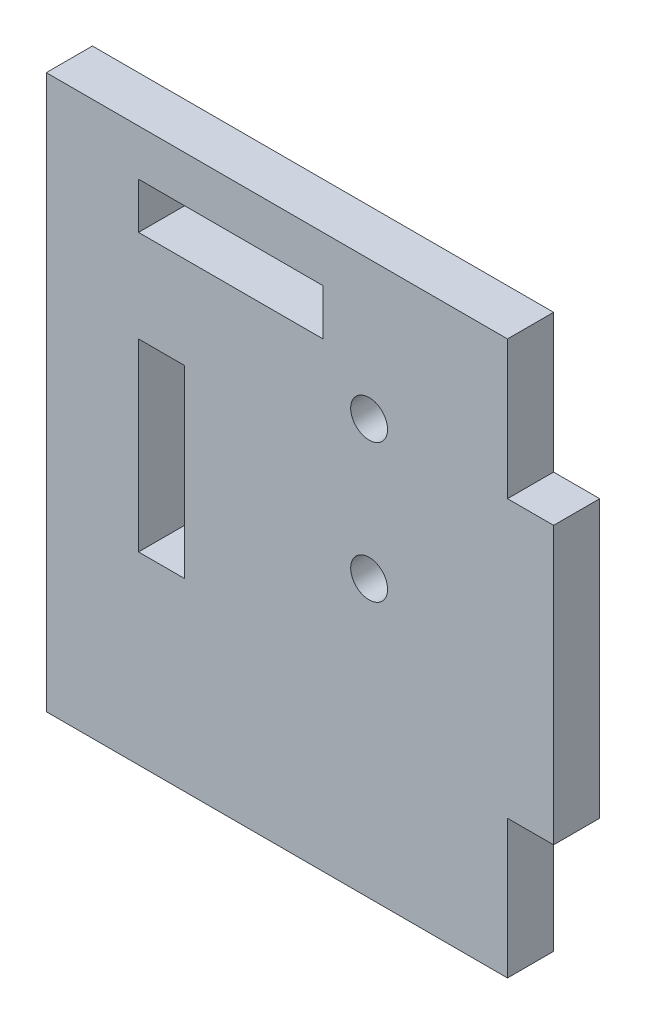
ISO-10303-21;
HEADER;
FILE_DESCRIPTION(('STEP AP214'),'2;1');
FILE_NAME('part.step','',(''),(''),'','','');
FILE_SCHEMA(('AUTOMOTIVE_DESIGN { 1 0 10303 214 1 1 1 1 }'));
ENDSEC;
DATA;
#1=APPLICATION_CONTEXT('core data for automotive mechanical design processes');
#2=APPLICATION_PROTOCOL_DEFINITION('international standard','automotive_design',2000,#1);
#3=PRODUCT_CONTEXT('',#1,'mechanical');
#4=PRODUCT('Part','Part','',(#3));
#5=PRODUCT_RELATED_PRODUCT_CATEGORY('part','',(#4));
#6=PRODUCT_DEFINITION_FORMATION('','',#4);
#7=PRODUCT_DEFINITION_CONTEXT('part definition',#1,'design');
#8=PRODUCT_DEFINITION('design','',#6,#7);
#9=PRODUCT_DEFINITION_SHAPE('','',#8);
#10=(LENGTH_UNIT() NAMED_UNIT(*) SI_UNIT(.MILLI.,.METRE.));
#11=(NAMED_UNIT(*) PLANE_ANGLE_UNIT() SI_UNIT($,.RADIAN.));
#12=(NAMED_UNIT(*) SI_UNIT($,.STERADIAN.) SOLID_ANGLE_UNIT());
#13=UNCERTAINTY_MEASURE_WITH_UNIT(LENGTH_MEASURE(1.E-05),#10,'distance_accuracy_value','');
#14=(GEOMETRIC_REPRESENTATION_CONTEXT(3) GLOBAL_UNCERTAINTY_ASSIGNED_CONTEXT((#13)) GLOBAL_UNIT_ASSIGNED_CONTEXT((#10,
#11,#12)) REPRESENTATION_CONTEXT('',''));
#15=CARTESIAN_POINT('',(0.,0.,0.));
#16=DIRECTION('',(0.,0.,1.));
#17=DIRECTION('',(1.,0.,0.));
#18=AXIS2_PLACEMENT_3D('',#15,#16,#17);
#19=CARTESIAN_POINT('',(0.,0.,5.));
#20=DIRECTION('',(0.,0.,-1.));
#21=DIRECTION('',(-1.,0.,0.));
#22=AXIS2_PLACEMENT_3D('',#19,#20,#21);
#23=PLANE('',#22);
#24=DIRECTION('',(0.,-1.,0.));
#25=VECTOR('',#24,1.);
#26=CARTESIAN_POINT('',(-45.,40.,5.));
#27=LINE('',#26,#25);
#28=CARTESIAN_POINT('',(-45.,40.,5.));
#29=VERTEX_POINT('',#28);
#30=CARTESIAN_POINT('',(-45.,35.,5.));
#31=VERTEX_POINT('',#30);
#32=EDGE_CURVE('E184',#29,#31,#27,.T.);
#33=ORIENTED_EDGE('',*,*,#32,.F.);
#34=DIRECTION('',(-1.,0.,0.));
#35=VECTOR('',#34,1.);
#36=CARTESIAN_POINT('',(-45.,40.,5.));
#37=LINE('',#36,#35);
#38=CARTESIAN_POINT('',(-25.,40.,5.));
#39=VERTEX_POINT('',#38);
#40=EDGE_CURVE('E192',#39,#29,#37,.T.);
#41=ORIENTED_EDGE('',*,*,#40,.F.);
#42=DIRECTION('',(0.,1.,0.));
#43=VECTOR('',#42,1.);
#44=CARTESIAN_POINT('',(-25.,40.,5.));
#45=LINE('',#44,#43);
#46=CARTESIAN_POINT('',(-25.,35.,5.));
#47=VERTEX_POINT('',#46);
#48=EDGE_CURVE('E189',#47,#39,#45,.T.);
#49=ORIENTED_EDGE('',*,*,#48,.F.);
#50=DIRECTION('',(1.,0.,0.));
#51=VECTOR('',#50,1.);
#52=CARTESIAN_POINT('',(-45.,35.,5.));
#53=LINE('',#52,#51);
#54=EDGE_CURVE('E186',#31,#47,#53,.T.);
#55=ORIENTED_EDGE('',*,*,#54,.F.);
#56=EDGE_LOOP('',(#33,#41,#49,#55));
#57=FACE_BOUND('',#56,.T.);
#58=DIRECTION('',(0.,-1.,0.));
#59=VECTOR('',#58,1.);
#60=CARTESIAN_POINT('',(-55.,-15.,5.));
#61=LINE('',#60,#59);
#62=CARTESIAN_POINT('',(-55.,45.,5.));
#63=VERTEX_POINT('',#62);
#64=CARTESIAN_POINT('',(-55.,-15.,5.));
#65=VERTEX_POINT('',#64);
#66=EDGE_CURVE('E215',#63,#65,#61,.T.);
#67=ORIENTED_EDGE('',*,*,#66,.T.);
#68=DIRECTION('',(1.,0.,0.));
#69=VECTOR('',#68,1.);
#70=CARTESIAN_POINT('',(-5.,-15.,5.));
#71=LINE('',#70,#69);
#72=CARTESIAN_POINT('',(-5.,-15.,5.));
#73=VERTEX_POINT('',#72);
#74=EDGE_CURVE('E218',#65,#73,#71,.T.);
#75=ORIENTED_EDGE('',*,*,#74,.T.);
#76=DIRECTION('',(0.,1.,0.));
#77=VECTOR('',#76,1.);
#78=CARTESIAN_POINT('',(-5.,0.,5.));
#79=LINE('',#78,#77);
#80=CARTESIAN_POINT('',(-5.,0.,5.));
#81=VERTEX_POINT('',#80);
#82=EDGE_CURVE('E221',#73,#81,#79,.T.);
#83=ORIENTED_EDGE('',*,*,#82,.T.);
#84=DIRECTION('',(1.,0.,0.));
#85=VECTOR('',#84,1.);
#86=CARTESIAN_POINT('',(0.,0.,5.));
#87=LINE('',#86,#85);
#88=CARTESIAN_POINT('',(0.,0.,5.));
#89=VERTEX_POINT('',#88);
#90=EDGE_CURVE('E223',#81,#89,#87,.T.);
#91=ORIENTED_EDGE('',*,*,#90,.T.);
#92=DIRECTION('',(0.,1.,0.));
#93=VECTOR('',#92,1.);
#94=CARTESIAN_POINT('',(0.,0.,5.));
#95=LINE('',#94,#93);
#96=CARTESIAN_POINT('',(0.,30.,5.));
#97=VERTEX_POINT('',#96);
#98=EDGE_CURVE('E225',#89,#97,#95,.T.);
#99=ORIENTED_EDGE('',*,*,#98,.T.);
#100=DIRECTION('',(-1.,0.,0.));
#101=VECTOR('',#100,1.);
#102=CARTESIAN_POINT('',(0.,30.,5.));
#103=LINE('',#102,#101);
#104=CARTESIAN_POINT('',(-5.,30.,5.));
#105=VERTEX_POINT('',#104);
#106=EDGE_CURVE('E227',#97,#105,#103,.T.);
#107=ORIENTED_EDGE('',*,*,#106,.T.);
#108=DIRECTION('',(0.,1.,0.));
#109=VECTOR('',#108,1.);
#110=CARTESIAN_POINT('',(-5.,30.,5.));
#111=LINE('',#110,#109);
#112=CARTESIAN_POINT('',(-5.,45.,5.));
#113=VERTEX_POINT('',#112);
#114=EDGE_CURVE('E229',#105,#113,#111,.T.);
#115=ORIENTED_EDGE('',*,*,#114,.T.);
#116=DIRECTION('',(-1.,0.,0.));
#117=VECTOR('',#116,1.);
#118=CARTESIAN_POINT('',(-55.,45.,5.));
#119=LINE('',#118,#117);
#120=EDGE_CURVE('E231',#113,#63,#119,.T.);
#121=ORIENTED_EDGE('',*,*,#120,.T.);
#122=EDGE_LOOP('',(#67,#75,#83,#91,#99,#107,#115,#121));
#123=FACE_BOUND('',#122,.T.);
#124=DIRECTION('',(0.,1.,0.));
#125=VECTOR('',#124,1.);
#126=CARTESIAN_POINT('',(-40.,25.,5.));
#127=LINE('',#126,#125);
#128=CARTESIAN_POINT('',(-40.,4.99999999999999,5.));
#129=VERTEX_POINT('',#128);
#130=CARTESIAN_POINT('',(-40.,25.,5.));
#131=VERTEX_POINT('',#130);
#132=EDGE_CURVE('E145',#129,#131,#127,.T.);
#133=ORIENTED_EDGE('',*,*,#132,.F.);
#134=DIRECTION('',(1.,0.,0.));
#135=VECTOR('',#134,1.);
#136=CARTESIAN_POINT('',(-40.,4.99999999999999,5.));
#137=LINE('',#136,#135);
#138=CARTESIAN_POINT('',(-45.,4.99999999999999,5.));
#139=VERTEX_POINT('',#138);
#140=EDGE_CURVE('E168',#139,#129,#137,.T.);
#141=ORIENTED_EDGE('',*,*,#140,.F.);
#142=DIRECTION('',(0.,-1.,0.));
#143=VECTOR('',#142,1.);
#144=CARTESIAN_POINT('',(-45.,25.,5.));
#145=LINE('',#144,#143);
#146=CARTESIAN_POINT('',(-45.,25.,5.));
#147=VERTEX_POINT('',#146);
#148=EDGE_CURVE('E166',#147,#139,#145,.T.);
#149=ORIENTED_EDGE('',*,*,#148,.F.);
#150=DIRECTION('',(-1.,0.,0.));
#151=VECTOR('',#150,1.);
#152=CARTESIAN_POINT('',(-40.,25.,5.));
#153=LINE('',#152,#151);
#154=EDGE_CURVE('E153',#131,#147,#153,.T.);
#155=ORIENTED_EDGE('',*,*,#154,.F.);
#156=EDGE_LOOP('',(#133,#141,#149,#155));
#157=FACE_BOUND('',#156,.T.);
#158=CARTESIAN_POINT('',(-20.,30.,5.));
#159=DIRECTION('',(0.,0.,1.));
#160=DIRECTION('',(1.,0.,0.));
#161=AXIS2_PLACEMENT_3D('',#158,#159,#160);
#162=CIRCLE('',#161,2.00000000000001);
#163=CARTESIAN_POINT('',(-18.,30.,5.));
#164=VERTEX_POINT('',#163);
#165=EDGE_CURVE('E174',#164,#164,#162,.T.);
#166=ORIENTED_EDGE('',*,*,#165,.F.);
#167=EDGE_LOOP('',(#166));
#168=FACE_BOUND('',#167,.T.);
#169=CARTESIAN_POINT('',(-20.,15.,5.));
#170=DIRECTION('',(0.,0.,1.));
#171=DIRECTION('',(1.,0.,0.));
#172=AXIS2_PLACEMENT_3D('',#169,#170,#171);
#173=CIRCLE('',#172,2.);
#174=CARTESIAN_POINT('',(-18.,15.,5.));
#175=VERTEX_POINT('',#174);
#176=EDGE_CURVE('E381',#175,#175,#173,.T.);
#177=ORIENTED_EDGE('',*,*,#176,.F.);
#178=EDGE_LOOP('',(#177));
#179=FACE_BOUND('',#178,.T.);
#180=ADVANCED_FACE('F32',(#57,#123,#157,#168,#179),#23,.F.);
#181=CARTESIAN_POINT('',(0.,0.,0.));
#182=DIRECTION('',(0.,0.,-1.));
#183=DIRECTION('',(-1.,0.,0.));
#184=AXIS2_PLACEMENT_3D('',#181,#182,#183);
#185=PLANE('',#184);
#186=CARTESIAN_POINT('',(-20.,30.,0.));
#187=DIRECTION('',(0.,0.,1.));
#188=DIRECTION('',(1.,0.,0.));
#189=AXIS2_PLACEMENT_3D('',#186,#187,#188);
#190=CIRCLE('',#189,2.00000000000001);
#191=CARTESIAN_POINT('',(-18.,30.,0.));
#192=VERTEX_POINT('',#191);
#193=EDGE_CURVE('E387',#192,#192,#190,.T.);
#194=ORIENTED_EDGE('',*,*,#193,.T.);
#195=EDGE_LOOP('',(#194));
#196=FACE_BOUND('',#195,.T.);
#197=DIRECTION('',(0.,-1.,0.));
#198=VECTOR('',#197,1.);
#199=CARTESIAN_POINT('',(-55.,-15.,0.));
#200=LINE('',#199,#198);
#201=CARTESIAN_POINT('',(-55.,45.,0.));
#202=VERTEX_POINT('',#201);
#203=CARTESIAN_POINT('',(-55.,-15.,0.));
#204=VERTEX_POINT('',#203);
#205=EDGE_CURVE('E214',#202,#204,#200,.T.);
#206=ORIENTED_EDGE('',*,*,#205,.F.);
#207=DIRECTION('',(-1.,0.,0.));
#208=VECTOR('',#207,1.);
#209=CARTESIAN_POINT('',(-55.,45.,0.));
#210=LINE('',#209,#208);
#211=CARTESIAN_POINT('',(-5.,45.,0.));
#212=VERTEX_POINT('',#211);
#213=EDGE_CURVE('E219',#212,#202,#210,.T.);
#214=ORIENTED_EDGE('',*,*,#213,.F.);
#215=DIRECTION('',(0.,1.,0.));
#216=VECTOR('',#215,1.);
#217=CARTESIAN_POINT('',(-5.,30.,0.));
#218=LINE('',#217,#216);
#219=CARTESIAN_POINT('',(-5.,30.,0.));
#220=VERTEX_POINT('',#219);
#221=EDGE_CURVE('E246',#220,#212,#218,.T.);
#222=ORIENTED_EDGE('',*,*,#221,.F.);
#223=DIRECTION('',(-1.,0.,0.));
#224=VECTOR('',#223,1.);
#225=CARTESIAN_POINT('',(0.,30.,0.));
#226=LINE('',#225,#224);
#227=CARTESIAN_POINT('',(0.,30.,0.));
#228=VERTEX_POINT('',#227);
#229=EDGE_CURVE('E244',#228,#220,#226,.T.);
#230=ORIENTED_EDGE('',*,*,#229,.F.);
#231=DIRECTION('',(0.,1.,0.));
#232=VECTOR('',#231,1.);
#233=CARTESIAN_POINT('',(0.,0.,0.));
#234=LINE('',#233,#232);
#235=CARTESIAN_POINT('',(0.,0.,0.));
#236=VERTEX_POINT('',#235);
#237=EDGE_CURVE('E242',#236,#228,#234,.T.);
#238=ORIENTED_EDGE('',*,*,#237,.F.);
#239=DIRECTION('',(1.,0.,0.));
#240=VECTOR('',#239,1.);
#241=CARTESIAN_POINT('',(0.,0.,0.));
#242=LINE('',#241,#240);
#243=CARTESIAN_POINT('',(-5.,0.,0.));
#244=VERTEX_POINT('',#243);
#245=EDGE_CURVE('E240',#244,#236,#242,.T.);
#246=ORIENTED_EDGE('',*,*,#245,.F.);
#247=DIRECTION('',(0.,1.,0.));
#248=VECTOR('',#247,1.);
#249=CARTESIAN_POINT('',(-5.,0.,0.));
#250=LINE('',#249,#248);
#251=CARTESIAN_POINT('',(-5.,-15.,0.));
#252=VERTEX_POINT('',#251);
#253=EDGE_CURVE('E238',#252,#244,#250,.T.);
#254=ORIENTED_EDGE('',*,*,#253,.F.);
#255=DIRECTION('',(1.,0.,0.));
#256=VECTOR('',#255,1.);
#257=CARTESIAN_POINT('',(-5.,-15.,0.));
#258=LINE('',#257,#256);
#259=EDGE_CURVE('E236',#204,#252,#258,.T.);
#260=ORIENTED_EDGE('',*,*,#259,.F.);
#261=EDGE_LOOP('',(#206,#214,#222,#230,#238,#246,#254,#260));
#262=FACE_BOUND('',#261,.T.);
#263=DIRECTION('',(-1.,0.,0.));
#264=VECTOR('',#263,1.);
#265=CARTESIAN_POINT('',(-45.,40.,0.));
#266=LINE('',#265,#264);
#267=CARTESIAN_POINT('',(-25.,40.,0.));
#268=VERTEX_POINT('',#267);
#269=CARTESIAN_POINT('',(-45.,40.,0.));
#270=VERTEX_POINT('',#269);
#271=EDGE_CURVE('E187',#268,#270,#266,.T.);
#272=ORIENTED_EDGE('',*,*,#271,.T.);
#273=DIRECTION('',(0.,-1.,0.));
#274=VECTOR('',#273,1.);
#275=CARTESIAN_POINT('',(-45.,40.,0.));
#276=LINE('',#275,#274);
#277=CARTESIAN_POINT('',(-45.,35.,0.));
#278=VERTEX_POINT('',#277);
#279=EDGE_CURVE('E161',#270,#278,#276,.T.);
#280=ORIENTED_EDGE('',*,*,#279,.T.);
#281=DIRECTION('',(1.,0.,0.));
#282=VECTOR('',#281,1.);
#283=CARTESIAN_POINT('',(-45.,35.,0.));
#284=LINE('',#283,#282);
#285=CARTESIAN_POINT('',(-25.,35.,0.));
#286=VERTEX_POINT('',#285);
#287=EDGE_CURVE('E197',#278,#286,#284,.T.);
#288=ORIENTED_EDGE('',*,*,#287,.T.);
#289=DIRECTION('',(0.,1.,0.));
#290=VECTOR('',#289,1.);
#291=CARTESIAN_POINT('',(-25.,40.,0.));
#292=LINE('',#291,#290);
#293=EDGE_CURVE('E200',#286,#268,#292,.T.);
#294=ORIENTED_EDGE('',*,*,#293,.T.);
#295=EDGE_LOOP('',(#272,#280,#288,#294));
#296=FACE_BOUND('',#295,.T.);
#297=DIRECTION('',(1.,0.,0.));
#298=VECTOR('',#297,1.);
#299=CARTESIAN_POINT('',(-40.,4.99999999999999,0.));
#300=LINE('',#299,#298);
#301=CARTESIAN_POINT('',(-45.,4.99999999999999,0.));
#302=VERTEX_POINT('',#301);
#303=CARTESIAN_POINT('',(-40.,4.99999999999999,0.));
#304=VERTEX_POINT('',#303);
#305=EDGE_CURVE('E154',#302,#304,#300,.T.);
#306=ORIENTED_EDGE('',*,*,#305,.T.);
#307=DIRECTION('',(0.,1.,0.));
#308=VECTOR('',#307,1.);
#309=CARTESIAN_POINT('',(-40.,25.,0.));
#310=LINE('',#309,#308);
#311=CARTESIAN_POINT('',(-40.,25.,0.));
#312=VERTEX_POINT('',#311);
#313=EDGE_CURVE('E55',#304,#312,#310,.T.);
#314=ORIENTED_EDGE('',*,*,#313,.T.);
#315=DIRECTION('',(-1.,0.,0.));
#316=VECTOR('',#315,1.);
#317=CARTESIAN_POINT('',(-40.,25.,0.));
#318=LINE('',#317,#316);
#319=CARTESIAN_POINT('',(-45.,25.,0.));
#320=VERTEX_POINT('',#319);
#321=EDGE_CURVE('E160',#312,#320,#318,.T.);
#322=ORIENTED_EDGE('',*,*,#321,.T.);
#323=DIRECTION('',(0.,-1.,0.));
#324=VECTOR('',#323,1.);
#325=CARTESIAN_POINT('',(-45.,25.,0.));
#326=LINE('',#325,#324);
#327=EDGE_CURVE('E176',#320,#302,#326,.T.);
#328=ORIENTED_EDGE('',*,*,#327,.T.);
#329=EDGE_LOOP('',(#306,#314,#322,#328));
#330=FACE_BOUND('',#329,.T.);
#331=CARTESIAN_POINT('',(-20.,15.,0.));
#332=DIRECTION('',(0.,0.,1.));
#333=DIRECTION('',(1.,0.,0.));
#334=AXIS2_PLACEMENT_3D('',#331,#332,#333);
#335=CIRCLE('',#334,2.);
#336=CARTESIAN_POINT('',(-18.,15.,0.));
#337=VERTEX_POINT('',#336);
#338=EDGE_CURVE('E384',#337,#337,#335,.T.);
#339=ORIENTED_EDGE('',*,*,#338,.T.);
#340=EDGE_LOOP('',(#339));
#341=FACE_BOUND('',#340,.T.);
#342=ADVANCED_FACE('F276',(#196,#262,#296,#330,#341),#185,.T.);
#343=CARTESIAN_POINT('',(-55.,-15.,5.));
#344=DIRECTION('',(1.,0.,0.));
#345=DIRECTION('',(0.,0.,-1.));
#346=AXIS2_PLACEMENT_3D('',#343,#344,#345);
#347=PLANE('',#346);
#348=ORIENTED_EDGE('',*,*,#205,.T.);
#349=DIRECTION('',(0.,0.,-1.));
#350=VECTOR('',#349,1.);
#351=CARTESIAN_POINT('',(-55.,-15.,5.));
#352=LINE('',#351,#350);
#353=EDGE_CURVE('E11',#65,#204,#352,.T.);
#354=ORIENTED_EDGE('',*,*,#353,.F.);
#355=ORIENTED_EDGE('',*,*,#66,.F.);
#356=DIRECTION('',(0.,0.,-1.));
#357=VECTOR('',#356,1.);
#358=CARTESIAN_POINT('',(-55.,45.,5.));
#359=LINE('',#358,#357);
#360=EDGE_CURVE('E233',#63,#202,#359,.T.);
#361=ORIENTED_EDGE('',*,*,#360,.T.);
#362=EDGE_LOOP('',(#348,#354,#355,#361));
#363=FACE_BOUND('',#362,.T.);
#364=ADVANCED_FACE('F34',(#363),#347,.F.);
#365=CARTESIAN_POINT('',(-5.,-15.,5.));
#366=DIRECTION('',(0.,1.,0.));
#367=DIRECTION('',(-1.,0.,0.));
#368=AXIS2_PLACEMENT_3D('',#365,#366,#367);
#369=PLANE('',#368);
#370=ORIENTED_EDGE('',*,*,#259,.T.);
#371=DIRECTION('',(0.,0.,-1.));
#372=VECTOR('',#371,1.);
#373=CARTESIAN_POINT('',(-5.,-15.,5.));
#374=LINE('',#373,#372);
#375=EDGE_CURVE('E40',#73,#252,#374,.T.);
#376=ORIENTED_EDGE('',*,*,#375,.F.);
#377=ORIENTED_EDGE('',*,*,#74,.F.);
#378=ORIENTED_EDGE('',*,*,#353,.T.);
#379=EDGE_LOOP('',(#370,#376,#377,#378));
#380=FACE_BOUND('',#379,.T.);
#381=ADVANCED_FACE('F293',(#380),#369,.F.);
#382=CARTESIAN_POINT('',(-5.,0.,5.));
#383=DIRECTION('',(-1.,0.,0.));
#384=DIRECTION('',(0.,-1.,0.));
#385=AXIS2_PLACEMENT_3D('',#382,#383,#384);
#386=PLANE('',#385);
#387=ORIENTED_EDGE('',*,*,#253,.T.);
#388=DIRECTION('',(0.,0.,-1.));
#389=VECTOR('',#388,1.);
#390=CARTESIAN_POINT('',(-5.,0.,5.));
#391=LINE('',#390,#389);
#392=EDGE_CURVE('E263',#81,#244,#391,.T.);
#393=ORIENTED_EDGE('',*,*,#392,.F.);
#394=ORIENTED_EDGE('',*,*,#82,.F.);
#395=ORIENTED_EDGE('',*,*,#375,.T.);
#396=EDGE_LOOP('',(#387,#393,#394,#395));
#397=FACE_BOUND('',#396,.T.);
#398=ADVANCED_FACE('F270',(#397),#386,.F.);
#399=CARTESIAN_POINT('',(0.,0.,5.));
#400=DIRECTION('',(0.,1.,0.));
#401=DIRECTION('',(-1.,0.,0.));
#402=AXIS2_PLACEMENT_3D('',#399,#400,#401);
#403=PLANE('',#402);
#404=ORIENTED_EDGE('',*,*,#245,.T.);
#405=DIRECTION('',(0.,0.,-1.));
#406=VECTOR('',#405,1.);
#407=CARTESIAN_POINT('',(0.,0.,5.));
#408=LINE('',#407,#406);
#409=EDGE_CURVE('E260',#89,#236,#408,.T.);
#410=ORIENTED_EDGE('',*,*,#409,.F.);
#411=ORIENTED_EDGE('',*,*,#90,.F.);
#412=ORIENTED_EDGE('',*,*,#392,.T.);
#413=EDGE_LOOP('',(#404,#410,#411,#412));
#414=FACE_BOUND('',#413,.T.);
#415=ADVANCED_FACE('F282',(#414),#403,.F.);
#416=CARTESIAN_POINT('',(0.,0.,5.));
#417=DIRECTION('',(-1.,0.,0.));
#418=DIRECTION('',(0.,0.,1.));
#419=AXIS2_PLACEMENT_3D('',#416,#417,#418);
#420=PLANE('',#419);
#421=ORIENTED_EDGE('',*,*,#237,.T.);
#422=DIRECTION('',(0.,0.,-1.));
#423=VECTOR('',#422,1.);
#424=CARTESIAN_POINT('',(0.,30.,5.));
#425=LINE('',#424,#423);
#426=EDGE_CURVE('E257',#97,#228,#425,.T.);
#427=ORIENTED_EDGE('',*,*,#426,.F.);
#428=ORIENTED_EDGE('',*,*,#98,.F.);
#429=ORIENTED_EDGE('',*,*,#409,.T.);
#430=EDGE_LOOP('',(#421,#427,#428,#429));
#431=FACE_BOUND('',#430,.T.);
#432=ADVANCED_FACE('F286',(#431),#420,.F.);
#433=CARTESIAN_POINT('',(0.,30.,5.));
#434=DIRECTION('',(0.,-1.,0.));
#435=DIRECTION('',(1.,0.,0.));
#436=AXIS2_PLACEMENT_3D('',#433,#434,#435);
#437=PLANE('',#436);
#438=ORIENTED_EDGE('',*,*,#229,.T.);
#439=DIRECTION('',(0.,0.,-1.));
#440=VECTOR('',#439,1.);
#441=CARTESIAN_POINT('',(-5.,30.,5.));
#442=LINE('',#441,#440);
#443=EDGE_CURVE('E254',#105,#220,#442,.T.);
#444=ORIENTED_EDGE('',*,*,#443,.F.);
#445=ORIENTED_EDGE('',*,*,#106,.F.);
#446=ORIENTED_EDGE('',*,*,#426,.T.);
#447=EDGE_LOOP('',(#438,#444,#445,#446));
#448=FACE_BOUND('',#447,.T.);
#449=ADVANCED_FACE('F306',(#448),#437,.F.);
#450=CARTESIAN_POINT('',(-5.,30.,5.));
#451=DIRECTION('',(-1.,0.,0.));
#452=DIRECTION('',(0.,-1.,0.));
#453=AXIS2_PLACEMENT_3D('',#450,#451,#452);
#454=PLANE('',#453);
#455=ORIENTED_EDGE('',*,*,#221,.T.);
#456=DIRECTION('',(0.,0.,-1.));
#457=VECTOR('',#456,1.);
#458=CARTESIAN_POINT('',(-5.,45.,5.));
#459=LINE('',#458,#457);
#460=EDGE_CURVE('E251',#113,#212,#459,.T.);
#461=ORIENTED_EDGE('',*,*,#460,.F.);
#462=ORIENTED_EDGE('',*,*,#114,.F.);
#463=ORIENTED_EDGE('',*,*,#443,.T.);
#464=EDGE_LOOP('',(#455,#461,#462,#463));
#465=FACE_BOUND('',#464,.T.);
#466=ADVANCED_FACE('F304',(#465),#454,.F.);
#467=CARTESIAN_POINT('',(-55.,45.,5.));
#468=DIRECTION('',(0.,-1.,0.));
#469=DIRECTION('',(0.,0.,-1.));
#470=AXIS2_PLACEMENT_3D('',#467,#468,#469);
#471=PLANE('',#470);
#472=ORIENTED_EDGE('',*,*,#213,.T.);
#473=ORIENTED_EDGE('',*,*,#360,.F.);
#474=ORIENTED_EDGE('',*,*,#120,.F.);
#475=ORIENTED_EDGE('',*,*,#460,.T.);
#476=EDGE_LOOP('',(#472,#473,#474,#475));
#477=FACE_BOUND('',#476,.T.);
#478=ADVANCED_FACE('F299',(#477),#471,.F.);
#479=CARTESIAN_POINT('',(-45.,40.,5.));
#480=DIRECTION('',(1.,0.,0.));
#481=DIRECTION('',(0.,0.,-1.));
#482=AXIS2_PLACEMENT_3D('',#479,#480,#481);
#483=PLANE('',#482);
#484=ORIENTED_EDGE('',*,*,#279,.F.);
#485=DIRECTION('',(0.,0.,-1.));
#486=VECTOR('',#485,1.);
#487=CARTESIAN_POINT('',(-45.,40.,5.));
#488=LINE('',#487,#486);
#489=EDGE_CURVE('E194',#29,#270,#488,.T.);
#490=ORIENTED_EDGE('',*,*,#489,.F.);
#491=ORIENTED_EDGE('',*,*,#32,.T.);
#492=DIRECTION('',(0.,0.,-1.));
#493=VECTOR('',#492,1.);
#494=CARTESIAN_POINT('',(-45.,35.,5.));
#495=LINE('',#494,#493);
#496=EDGE_CURVE('E211',#31,#278,#495,.T.);
#497=ORIENTED_EDGE('',*,*,#496,.T.);
#498=EDGE_LOOP('',(#484,#490,#491,#497));
#499=FACE_BOUND('',#498,.T.);
#500=ADVANCED_FACE('F325',(#499),#483,.T.);
#501=CARTESIAN_POINT('',(-45.,35.,5.));
#502=DIRECTION('',(0.,1.,0.));
#503=DIRECTION('',(0.,0.,1.));
#504=AXIS2_PLACEMENT_3D('',#501,#502,#503);
#505=PLANE('',#504);
#506=ORIENTED_EDGE('',*,*,#287,.F.);
#507=ORIENTED_EDGE('',*,*,#496,.F.);
#508=ORIENTED_EDGE('',*,*,#54,.T.);
#509=DIRECTION('',(0.,0.,-1.));
#510=VECTOR('',#509,1.);
#511=CARTESIAN_POINT('',(-25.,35.,5.));
#512=LINE('',#511,#510);
#513=EDGE_CURVE('E209',#47,#286,#512,.T.);
#514=ORIENTED_EDGE('',*,*,#513,.T.);
#515=EDGE_LOOP('',(#506,#507,#508,#514));
#516=FACE_BOUND('',#515,.T.);
#517=ADVANCED_FACE('F332',(#516),#505,.T.);
#518=CARTESIAN_POINT('',(-25.,40.,5.));
#519=DIRECTION('',(-1.,0.,0.));
#520=DIRECTION('',(0.,0.,1.));
#521=AXIS2_PLACEMENT_3D('',#518,#519,#520);
#522=PLANE('',#521);
#523=ORIENTED_EDGE('',*,*,#293,.F.);
#524=ORIENTED_EDGE('',*,*,#513,.F.);
#525=ORIENTED_EDGE('',*,*,#48,.T.);
#526=DIRECTION('',(0.,0.,-1.));
#527=VECTOR('',#526,1.);
#528=CARTESIAN_POINT('',(-25.,40.,5.));
#529=LINE('',#528,#527);
#530=EDGE_CURVE('E207',#39,#268,#529,.T.);
#531=ORIENTED_EDGE('',*,*,#530,.T.);
#532=EDGE_LOOP('',(#523,#524,#525,#531));
#533=FACE_BOUND('',#532,.T.);
#534=ADVANCED_FACE('F337',(#533),#522,.T.);
#535=CARTESIAN_POINT('',(-45.,40.,5.));
#536=DIRECTION('',(0.,-1.,0.));
#537=DIRECTION('',(0.,0.,-1.));
#538=AXIS2_PLACEMENT_3D('',#535,#536,#537);
#539=PLANE('',#538);
#540=ORIENTED_EDGE('',*,*,#271,.F.);
#541=ORIENTED_EDGE('',*,*,#530,.F.);
#542=ORIENTED_EDGE('',*,*,#40,.T.);
#543=ORIENTED_EDGE('',*,*,#489,.T.);
#544=EDGE_LOOP('',(#540,#541,#542,#543));
#545=FACE_BOUND('',#544,.T.);
#546=ADVANCED_FACE('F343',(#545),#539,.T.);
#547=CARTESIAN_POINT('',(-40.,25.,5.));
#548=DIRECTION('',(-1.,0.,0.));
#549=DIRECTION('',(0.,0.,1.));
#550=AXIS2_PLACEMENT_3D('',#547,#548,#549);
#551=PLANE('',#550);
#552=ORIENTED_EDGE('',*,*,#313,.F.);
#553=DIRECTION('',(0.,0.,-1.));
#554=VECTOR('',#553,1.);
#555=CARTESIAN_POINT('',(-40.,4.99999999999999,5.));
#556=LINE('',#555,#554);
#557=EDGE_CURVE('E149',#129,#304,#556,.T.);
#558=ORIENTED_EDGE('',*,*,#557,.F.);
#559=ORIENTED_EDGE('',*,*,#132,.T.);
#560=DIRECTION('',(0.,0.,-1.));
#561=VECTOR('',#560,1.);
#562=CARTESIAN_POINT('',(-40.,25.,5.));
#563=LINE('',#562,#561);
#564=EDGE_CURVE('E148',#131,#312,#563,.T.);
#565=ORIENTED_EDGE('',*,*,#564,.T.);
#566=EDGE_LOOP('',(#552,#558,#559,#565));
#567=FACE_BOUND('',#566,.T.);
#568=ADVANCED_FACE('F147',(#567),#551,.T.);
#569=CARTESIAN_POINT('',(-40.,25.,5.));
#570=DIRECTION('',(0.,-1.,0.));
#571=DIRECTION('',(1.,0.,0.));
#572=AXIS2_PLACEMENT_3D('',#569,#570,#571);
#573=PLANE('',#572);
#574=ORIENTED_EDGE('',*,*,#321,.F.);
#575=ORIENTED_EDGE('',*,*,#564,.F.);
#576=ORIENTED_EDGE('',*,*,#154,.T.);
#577=DIRECTION('',(0.,0.,-1.));
#578=VECTOR('',#577,1.);
#579=CARTESIAN_POINT('',(-45.,25.,5.));
#580=LINE('',#579,#578);
#581=EDGE_CURVE('E162',#147,#320,#580,.T.);
#582=ORIENTED_EDGE('',*,*,#581,.T.);
#583=EDGE_LOOP('',(#574,#575,#576,#582));
#584=FACE_BOUND('',#583,.T.);
#585=ADVANCED_FACE('F157',(#584),#573,.T.);
#586=CARTESIAN_POINT('',(-45.,25.,5.));
#587=DIRECTION('',(1.,0.,0.));
#588=DIRECTION('',(0.,1.,0.));
#589=AXIS2_PLACEMENT_3D('',#586,#587,#588);
#590=PLANE('',#589);
#591=ORIENTED_EDGE('',*,*,#327,.F.);
#592=ORIENTED_EDGE('',*,*,#581,.F.);
#593=ORIENTED_EDGE('',*,*,#148,.T.);
#594=DIRECTION('',(0.,0.,-1.));
#595=VECTOR('',#594,1.);
#596=CARTESIAN_POINT('',(-45.,4.99999999999999,5.));
#597=LINE('',#596,#595);
#598=EDGE_CURVE('E47',#139,#302,#597,.T.);
#599=ORIENTED_EDGE('',*,*,#598,.T.);
#600=EDGE_LOOP('',(#591,#592,#593,#599));
#601=FACE_BOUND('',#600,.T.);
#602=ADVANCED_FACE('F362',(#601),#590,.T.);
#603=CARTESIAN_POINT('',(-40.,4.99999999999999,5.));
#604=DIRECTION('',(0.,1.,0.));
#605=DIRECTION('',(-1.,0.,0.));
#606=AXIS2_PLACEMENT_3D('',#603,#604,#605);
#607=PLANE('',#606);
#608=ORIENTED_EDGE('',*,*,#305,.F.);
#609=ORIENTED_EDGE('',*,*,#598,.F.);
#610=ORIENTED_EDGE('',*,*,#140,.T.);
#611=ORIENTED_EDGE('',*,*,#557,.T.);
#612=EDGE_LOOP('',(#608,#609,#610,#611));
#613=FACE_BOUND('',#612,.T.);
#614=ADVANCED_FACE('F365',(#613),#607,.T.);
#615=CARTESIAN_POINT('',(-20.,30.,5.));
#616=DIRECTION('',(0.,0.,-1.));
#617=DIRECTION('',(-1.,0.,0.));
#618=AXIS2_PLACEMENT_3D('',#615,#616,#617);
#619=CYLINDRICAL_SURFACE('',#618,2.00000000000001);
#620=ORIENTED_EDGE('',*,*,#165,.T.);
#621=EDGE_LOOP('',(#620));
#622=FACE_BOUND('',#621,.T.);
#623=ORIENTED_EDGE('',*,*,#193,.F.);
#624=EDGE_LOOP('',(#623));
#625=FACE_BOUND('',#624,.T.);
#626=ADVANCED_FACE('F369',(#622,#625),#619,.F.);
#627=CARTESIAN_POINT('',(-20.,15.,5.));
#628=DIRECTION('',(0.,0.,-1.));
#629=DIRECTION('',(-1.,0.,0.));
#630=AXIS2_PLACEMENT_3D('',#627,#628,#629);
#631=CYLINDRICAL_SURFACE('',#630,2.);
#632=ORIENTED_EDGE('',*,*,#176,.T.);
#633=EDGE_LOOP('',(#632));
#634=FACE_BOUND('',#633,.T.);
#635=ORIENTED_EDGE('',*,*,#338,.F.);
#636=EDGE_LOOP('',(#635));
#637=FACE_BOUND('',#636,.T.);
#638=ADVANCED_FACE('F372',(#634,#637),#631,.F.);
#639=CLOSED_SHELL('',(#180,#342,#364,#381,#398,#415,#432,#449,#466,#478,#500,#517,#534,#546,
#568,#585,#602,#614,#626,#638));
#640=MANIFOLD_SOLID_BREP('B2',#639);
#641=ADVANCED_BREP_SHAPE_REPRESENTATION('',(#18,#640),#14);
#642=SHAPE_DEFINITION_REPRESENTATION(#9,#641);
ENDSEC;
END-ISO-10303-21;
